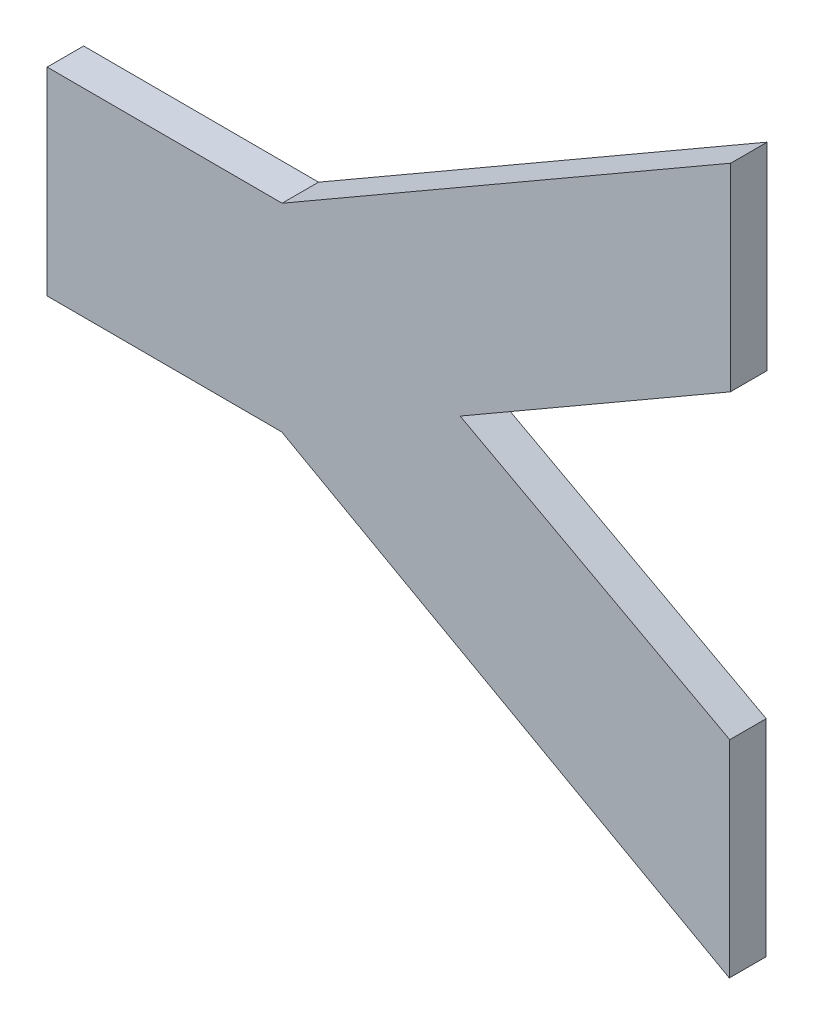
ISO-10303-21;
HEADER;
FILE_DESCRIPTION(('STEP AP214'),'2;1');
FILE_NAME('part.step','',(''),(''),'','','');
FILE_SCHEMA(('AUTOMOTIVE_DESIGN { 1 0 10303 214 1 1 1 1 }'));
ENDSEC;
DATA;
#1=APPLICATION_CONTEXT('core data for automotive mechanical design processes');
#2=APPLICATION_PROTOCOL_DEFINITION('international standard','automotive_design',2000,#1);
#3=PRODUCT_CONTEXT('',#1,'mechanical');
#4=PRODUCT('Part','Part','',(#3));
#5=PRODUCT_RELATED_PRODUCT_CATEGORY('part','',(#4));
#6=PRODUCT_DEFINITION_FORMATION('','',#4);
#7=PRODUCT_DEFINITION_CONTEXT('part definition',#1,'design');
#8=PRODUCT_DEFINITION('design','',#6,#7);
#9=PRODUCT_DEFINITION_SHAPE('','',#8);
#10=(LENGTH_UNIT() NAMED_UNIT(*) SI_UNIT(.MILLI.,.METRE.));
#11=(NAMED_UNIT(*) PLANE_ANGLE_UNIT() SI_UNIT($,.RADIAN.));
#12=(NAMED_UNIT(*) SI_UNIT($,.STERADIAN.) SOLID_ANGLE_UNIT());
#13=UNCERTAINTY_MEASURE_WITH_UNIT(LENGTH_MEASURE(1.E-05),#10,'distance_accuracy_value','');
#14=(GEOMETRIC_REPRESENTATION_CONTEXT(3) GLOBAL_UNCERTAINTY_ASSIGNED_CONTEXT((#13)) GLOBAL_UNIT_ASSIGNED_CONTEXT((#10,
#11,#12)) REPRESENTATION_CONTEXT('',''));
#15=CARTESIAN_POINT('',(0.,0.,0.));
#16=DIRECTION('',(0.,0.,1.));
#17=DIRECTION('',(1.,0.,0.));
#18=AXIS2_PLACEMENT_3D('',#15,#16,#17);
#19=CARTESIAN_POINT('',(-0.176957192412927,0.0781727937247201,-0.37));
#20=DIRECTION('',(0.500136953174427,-0.865946319392491,0.));
#21=DIRECTION('',(-0.865946319392491,-0.500136953174427,0.));
#22=AXIS2_PLACEMENT_3D('',#19,#20,#21);
#23=PLANE('',#22);
#24=DIRECTION('',(-0.865946319392491,-0.500136953174427,0.));
#25=VECTOR('',#24,1.);
#26=CARTESIAN_POINT('',(-0.176957192412927,0.0781727937247201,-0.37));
#27=LINE('',#26,#25);
#28=CARTESIAN_POINT('',(-0.176957192412927,0.0781727937247201,-0.37));
#29=VERTEX_POINT('',#28);
#30=CARTESIAN_POINT('',(-0.199172756407364,0.0653419470077734,-0.37));
#31=VERTEX_POINT('',#30);
#32=EDGE_CURVE('E11',#29,#31,#27,.T.);
#33=ORIENTED_EDGE('',*,*,#32,.T.);
#34=DIRECTION('',(0.,0.,-1.));
#35=VECTOR('',#34,1.);
#36=CARTESIAN_POINT('',(-0.199172756407364,0.0653419470077734,-0.37));
#37=LINE('',#36,#35);
#38=CARTESIAN_POINT('',(-0.199172756407364,0.0653419470077734,-0.373));
#39=VERTEX_POINT('',#38);
#40=EDGE_CURVE('E24',#31,#39,#37,.T.);
#41=ORIENTED_EDGE('',*,*,#40,.T.);
#42=DIRECTION('',(-0.865946319392491,-0.500136953174427,0.));
#43=VECTOR('',#42,1.);
#44=CARTESIAN_POINT('',(-0.176957192412927,0.0781727937247201,-0.373));
#45=LINE('',#44,#43);
#46=CARTESIAN_POINT('',(-0.176957192412927,0.0781727937247201,-0.373));
#47=VERTEX_POINT('',#46);
#48=EDGE_CURVE('E106',#47,#39,#45,.T.);
#49=ORIENTED_EDGE('',*,*,#48,.F.);
#50=DIRECTION('',(0.,0.,-1.));
#51=VECTOR('',#50,1.);
#52=CARTESIAN_POINT('',(-0.176957192412927,0.0781727937247201,-0.37));
#53=LINE('',#52,#51);
#54=EDGE_CURVE('E161',#29,#47,#53,.T.);
#55=ORIENTED_EDGE('',*,*,#54,.F.);
#56=EDGE_LOOP('',(#33,#41,#49,#55));
#57=FACE_BOUND('',#56,.T.);
#58=ADVANCED_FACE('F17',(#57),#23,.T.);
#59=CARTESIAN_POINT('',(-0.176925003119448,0.0944718361057899,-0.37));
#60=DIRECTION('',(0.999998049852571,-0.0019749154553029,0.));
#61=DIRECTION('',(-0.0019749154553029,-0.999998049852571,0.));
#62=AXIS2_PLACEMENT_3D('',#59,#60,#61);
#63=PLANE('',#62);
#64=DIRECTION('',(-0.0019749154553029,-0.999998049852571,0.));
#65=VECTOR('',#64,1.);
#66=CARTESIAN_POINT('',(-0.176925003119448,0.0944718361057899,-0.37));
#67=LINE('',#66,#65);
#68=CARTESIAN_POINT('',(-0.176925003119448,0.0944718361057899,-0.37));
#69=VERTEX_POINT('',#68);
#70=EDGE_CURVE('E158',#69,#29,#67,.T.);
#71=ORIENTED_EDGE('',*,*,#70,.T.);
#72=ORIENTED_EDGE('',*,*,#54,.T.);
#73=DIRECTION('',(-0.0019749154553029,-0.999998049852571,0.));
#74=VECTOR('',#73,1.);
#75=CARTESIAN_POINT('',(-0.176925003119448,0.0944718361057899,-0.373));
#76=LINE('',#75,#74);
#77=CARTESIAN_POINT('',(-0.176925003119448,0.0944718361057899,-0.373));
#78=VERTEX_POINT('',#77);
#79=EDGE_CURVE('E156',#78,#47,#76,.T.);
#80=ORIENTED_EDGE('',*,*,#79,.F.);
#81=DIRECTION('',(0.,0.,-1.));
#82=VECTOR('',#81,1.);
#83=CARTESIAN_POINT('',(-0.176925003119448,0.0944718361057899,-0.37));
#84=LINE('',#83,#82);
#85=EDGE_CURVE('E153',#69,#78,#84,.T.);
#86=ORIENTED_EDGE('',*,*,#85,.F.);
#87=EDGE_LOOP('',(#71,#72,#80,#86));
#88=FACE_BOUND('',#87,.T.);
#89=ADVANCED_FACE('F181',(#88),#63,.T.);
#90=CARTESIAN_POINT('',(-0.213813050896857,0.0731778596143159,-0.37));
#91=DIRECTION('',(-0.49994104857974,0.866059436727636,0.));
#92=DIRECTION('',(0.866059436727636,0.49994104857974,0.));
#93=AXIS2_PLACEMENT_3D('',#90,#91,#92);
#94=PLANE('',#93);
#95=DIRECTION('',(0.866059436727636,0.49994104857974,0.));
#96=VECTOR('',#95,1.);
#97=CARTESIAN_POINT('',(-0.213813050896857,0.0731778596143159,-0.37));
#98=LINE('',#97,#96);
#99=CARTESIAN_POINT('',(-0.213813050896857,0.0731778596143159,-0.37));
#100=VERTEX_POINT('',#99);
#101=EDGE_CURVE('E150',#100,#69,#98,.T.);
#102=ORIENTED_EDGE('',*,*,#101,.T.);
#103=ORIENTED_EDGE('',*,*,#85,.T.);
#104=DIRECTION('',(0.866059436727636,0.49994104857974,0.));
#105=VECTOR('',#104,1.);
#106=CARTESIAN_POINT('',(-0.213813050896857,0.0731778596143159,-0.373));
#107=LINE('',#106,#105);
#108=CARTESIAN_POINT('',(-0.213813050896857,0.0731778596143159,-0.373));
#109=VERTEX_POINT('',#108);
#110=EDGE_CURVE('E147',#109,#78,#107,.T.);
#111=ORIENTED_EDGE('',*,*,#110,.F.);
#112=DIRECTION('',(0.,0.,-1.));
#113=VECTOR('',#112,1.);
#114=CARTESIAN_POINT('',(-0.213813050896857,0.0731778596143159,-0.37));
#115=LINE('',#114,#113);
#116=EDGE_CURVE('E144',#100,#109,#115,.T.);
#117=ORIENTED_EDGE('',*,*,#116,.F.);
#118=EDGE_LOOP('',(#102,#103,#111,#117));
#119=FACE_BOUND('',#118,.T.);
#120=ADVANCED_FACE('F178',(#119),#94,.T.);
#121=CARTESIAN_POINT('',(-0.233126208974028,0.0732160015430742,-0.37));
#122=DIRECTION('',(0.0019749154552307,0.999998049852571,0.));
#123=DIRECTION('',(0.999998049852571,-0.0019749154552307,0.));
#124=AXIS2_PLACEMENT_3D('',#121,#122,#123);
#125=PLANE('',#124);
#126=DIRECTION('',(0.999998049852571,-0.0019749154552307,0.));
#127=VECTOR('',#126,1.);
#128=CARTESIAN_POINT('',(-0.233126208974028,0.0732160015430742,-0.37));
#129=LINE('',#128,#127);
#130=CARTESIAN_POINT('',(-0.233126208974028,0.0732160015430742,-0.37));
#131=VERTEX_POINT('',#130);
#132=EDGE_CURVE('E141',#131,#100,#129,.T.);
#133=ORIENTED_EDGE('',*,*,#132,.T.);
#134=ORIENTED_EDGE('',*,*,#116,.T.);
#135=DIRECTION('',(0.999998049852571,-0.0019749154552307,0.));
#136=VECTOR('',#135,1.);
#137=CARTESIAN_POINT('',(-0.233126208974028,0.0732160015430742,-0.373));
#138=LINE('',#137,#136);
#139=CARTESIAN_POINT('',(-0.233126208974028,0.0732160015430742,-0.373));
#140=VERTEX_POINT('',#139);
#141=EDGE_CURVE('E138',#140,#109,#138,.T.);
#142=ORIENTED_EDGE('',*,*,#141,.F.);
#143=DIRECTION('',(0.,0.,-1.));
#144=VECTOR('',#143,1.);
#145=CARTESIAN_POINT('',(-0.233126208974028,0.0732160015430742,-0.37));
#146=LINE('',#145,#144);
#147=EDGE_CURVE('E135',#131,#140,#146,.T.);
#148=ORIENTED_EDGE('',*,*,#147,.F.);
#149=EDGE_LOOP('',(#133,#134,#142,#148));
#150=FACE_BOUND('',#149,.T.);
#151=ADVANCED_FACE('F175',(#150),#125,.T.);
#152=CARTESIAN_POINT('',(-0.23315839940546,0.0569163829593786,-0.37));
#153=DIRECTION('',(-0.999998049852571,0.0019749154552519,0.));
#154=DIRECTION('',(0.0019749154552519,0.999998049852571,0.));
#155=AXIS2_PLACEMENT_3D('',#152,#153,#154);
#156=PLANE('',#155);
#157=DIRECTION('',(0.0019749154552519,0.999998049852571,0.));
#158=VECTOR('',#157,1.);
#159=CARTESIAN_POINT('',(-0.23315839940546,0.0569163829593786,-0.37));
#160=LINE('',#159,#158);
#161=CARTESIAN_POINT('',(-0.23315839940546,0.0569163829593786,-0.37));
#162=VERTEX_POINT('',#161);
#163=EDGE_CURVE('E132',#162,#131,#160,.T.);
#164=ORIENTED_EDGE('',*,*,#163,.T.);
#165=ORIENTED_EDGE('',*,*,#147,.T.);
#166=DIRECTION('',(0.0019749154552519,0.999998049852571,0.));
#167=VECTOR('',#166,1.);
#168=CARTESIAN_POINT('',(-0.23315839940546,0.0569163829593786,-0.373));
#169=LINE('',#168,#167);
#170=CARTESIAN_POINT('',(-0.23315839940546,0.0569163829593786,-0.373));
#171=VERTEX_POINT('',#170);
#172=EDGE_CURVE('E129',#171,#140,#169,.T.);
#173=ORIENTED_EDGE('',*,*,#172,.F.);
#174=DIRECTION('',(0.,0.,-1.));
#175=VECTOR('',#174,1.);
#176=CARTESIAN_POINT('',(-0.23315839940546,0.0569163829593786,-0.37));
#177=LINE('',#176,#175);
#178=EDGE_CURVE('E126',#162,#171,#177,.T.);
#179=ORIENTED_EDGE('',*,*,#178,.F.);
#180=EDGE_LOOP('',(#164,#165,#173,#179));
#181=FACE_BOUND('',#180,.T.);
#182=ADVANCED_FACE('F172',(#181),#156,.T.);
#183=CARTESIAN_POINT('',(-0.213845241328289,0.0568782410306203,-0.37));
#184=DIRECTION('',(-0.0019749154552312,-0.999998049852571,0.));
#185=DIRECTION('',(-0.999998049852571,0.0019749154552312,0.));
#186=AXIS2_PLACEMENT_3D('',#183,#184,#185);
#187=PLANE('',#186);
#188=DIRECTION('',(-0.999998049852571,0.0019749154552312,0.));
#189=VECTOR('',#188,1.);
#190=CARTESIAN_POINT('',(-0.213845241328289,0.0568782410306203,-0.37));
#191=LINE('',#190,#189);
#192=CARTESIAN_POINT('',(-0.213845241328289,0.0568782410306203,-0.37));
#193=VERTEX_POINT('',#192);
#194=EDGE_CURVE('E123',#193,#162,#191,.T.);
#195=ORIENTED_EDGE('',*,*,#194,.T.);
#196=ORIENTED_EDGE('',*,*,#178,.T.);
#197=DIRECTION('',(-0.999998049852571,0.0019749154552312,0.));
#198=VECTOR('',#197,1.);
#199=CARTESIAN_POINT('',(-0.213845241328289,0.0568782410306203,-0.373));
#200=LINE('',#199,#198);
#201=CARTESIAN_POINT('',(-0.213845241328289,0.0568782410306203,-0.373));
#202=VERTEX_POINT('',#201);
#203=EDGE_CURVE('E120',#202,#171,#200,.T.);
#204=ORIENTED_EDGE('',*,*,#203,.F.);
#205=DIRECTION('',(0.,0.,-1.));
#206=VECTOR('',#205,1.);
#207=CARTESIAN_POINT('',(-0.213845241328289,0.0568782410306203,-0.37));
#208=LINE('',#207,#206);
#209=EDGE_CURVE('E117',#193,#202,#208,.T.);
#210=ORIENTED_EDGE('',*,*,#209,.F.);
#211=EDGE_LOOP('',(#195,#196,#204,#210));
#212=FACE_BOUND('',#211,.T.);
#213=ADVANCED_FACE('F169',(#212),#187,.T.);
#214=CARTESIAN_POINT('',(-0.177039697462775,0.036396378065382,-0.37));
#215=DIRECTION('',(-0.486265776131108,-0.873810960656601,0.));
#216=DIRECTION('',(-0.873810960656601,0.486265776131108,0.));
#217=AXIS2_PLACEMENT_3D('',#214,#215,#216);
#218=PLANE('',#217);
#219=DIRECTION('',(-0.873810960656601,0.486265776131108,0.));
#220=VECTOR('',#219,1.);
#221=CARTESIAN_POINT('',(-0.177039697462775,0.036396378065382,-0.37));
#222=LINE('',#221,#220);
#223=CARTESIAN_POINT('',(-0.177039697462775,0.0363963780653821,-0.37));
#224=VERTEX_POINT('',#223);
#225=EDGE_CURVE('E114',#224,#193,#222,.T.);
#226=ORIENTED_EDGE('',*,*,#225,.T.);
#227=ORIENTED_EDGE('',*,*,#209,.T.);
#228=DIRECTION('',(-0.873810960656601,0.486265776131108,0.));
#229=VECTOR('',#228,1.);
#230=CARTESIAN_POINT('',(-0.177039697462775,0.036396378065382,-0.373));
#231=LINE('',#230,#229);
#232=CARTESIAN_POINT('',(-0.177039697462775,0.0363963780653821,-0.373));
#233=VERTEX_POINT('',#232);
#234=EDGE_CURVE('E112',#233,#202,#231,.T.);
#235=ORIENTED_EDGE('',*,*,#234,.F.);
#236=DIRECTION('',(0.,0.,-1.));
#237=VECTOR('',#236,1.);
#238=CARTESIAN_POINT('',(-0.177039697462775,0.0363963780653821,-0.37));
#239=LINE('',#238,#237);
#240=EDGE_CURVE('E91',#224,#233,#239,.T.);
#241=ORIENTED_EDGE('',*,*,#240,.F.);
#242=EDGE_LOOP('',(#226,#227,#235,#241));
#243=FACE_BOUND('',#242,.T.);
#244=ADVANCED_FACE('F167',(#243),#218,.T.);
#245=CARTESIAN_POINT('',(-0.177006152866559,0.0533816777192288,-0.37));
#246=DIRECTION('',(0.999998049852571,-0.0019749154552604,0.));
#247=DIRECTION('',(-0.0019749154552604,-0.999998049852571,0.));
#248=AXIS2_PLACEMENT_3D('',#245,#246,#247);
#249=PLANE('',#248);
#250=DIRECTION('',(-0.0019749154552604,-0.999998049852571,0.));
#251=VECTOR('',#250,1.);
#252=CARTESIAN_POINT('',(-0.177006152866559,0.0533816777192288,-0.37));
#253=LINE('',#252,#251);
#254=CARTESIAN_POINT('',(-0.177006152866559,0.0533816777192288,-0.37));
#255=VERTEX_POINT('',#254);
#256=EDGE_CURVE('E95',#255,#224,#253,.T.);
#257=ORIENTED_EDGE('',*,*,#256,.T.);
#258=ORIENTED_EDGE('',*,*,#240,.T.);
#259=DIRECTION('',(-0.0019749154552604,-0.999998049852571,0.));
#260=VECTOR('',#259,1.);
#261=CARTESIAN_POINT('',(-0.177006152866559,0.0533816777192288,-0.373));
#262=LINE('',#261,#260);
#263=CARTESIAN_POINT('',(-0.177006152866559,0.0533816777192288,-0.373));
#264=VERTEX_POINT('',#263);
#265=EDGE_CURVE('E84',#264,#233,#262,.T.);
#266=ORIENTED_EDGE('',*,*,#265,.F.);
#267=DIRECTION('',(0.,0.,-1.));
#268=VECTOR('',#267,1.);
#269=CARTESIAN_POINT('',(-0.177006152866559,0.0533816777192288,-0.37));
#270=LINE('',#269,#268);
#271=EDGE_CURVE('E88',#255,#264,#270,.T.);
#272=ORIENTED_EDGE('',*,*,#271,.F.);
#273=EDGE_LOOP('',(#257,#258,#266,#272));
#274=FACE_BOUND('',#273,.T.);
#275=ADVANCED_FACE('F87',(#274),#249,.T.);
#276=CARTESIAN_POINT('',(-0.199172756407364,0.0653419470077734,-0.37));
#277=DIRECTION('',(0.474850824016555,0.880066301440294,0.));
#278=DIRECTION('',(0.880066301440294,-0.474850824016555,0.));
#279=AXIS2_PLACEMENT_3D('',#276,#277,#278);
#280=PLANE('',#279);
#281=DIRECTION('',(0.880066301440295,-0.474850824016555,0.));
#282=VECTOR('',#281,1.);
#283=CARTESIAN_POINT('',(-0.199172756407364,0.0653419470077734,-0.37));
#284=LINE('',#283,#282);
#285=EDGE_CURVE('E101',#31,#255,#284,.T.);
#286=ORIENTED_EDGE('',*,*,#285,.T.);
#287=ORIENTED_EDGE('',*,*,#271,.T.);
#288=DIRECTION('',(0.880066301440295,-0.474850824016555,0.));
#289=VECTOR('',#288,1.);
#290=CARTESIAN_POINT('',(-0.199172756407364,0.0653419470077734,-0.373));
#291=LINE('',#290,#289);
#292=EDGE_CURVE('E100',#39,#264,#291,.T.);
#293=ORIENTED_EDGE('',*,*,#292,.F.);
#294=ORIENTED_EDGE('',*,*,#40,.F.);
#295=EDGE_LOOP('',(#286,#287,#293,#294));
#296=FACE_BOUND('',#295,.T.);
#297=ADVANCED_FACE('F99',(#296),#280,.T.);
#298=CARTESIAN_POINT('',(-0.205041701262454,0.065434107085586,-0.373));
#299=DIRECTION('',(0.,0.,-1.));
#300=DIRECTION('',(-1.,0.,0.));
#301=AXIS2_PLACEMENT_3D('',#298,#299,#300);
#302=PLANE('',#301);
#303=ORIENTED_EDGE('',*,*,#292,.T.);
#304=ORIENTED_EDGE('',*,*,#265,.T.);
#305=ORIENTED_EDGE('',*,*,#234,.T.);
#306=ORIENTED_EDGE('',*,*,#203,.T.);
#307=ORIENTED_EDGE('',*,*,#172,.T.);
#308=ORIENTED_EDGE('',*,*,#141,.T.);
#309=ORIENTED_EDGE('',*,*,#110,.T.);
#310=ORIENTED_EDGE('',*,*,#79,.T.);
#311=ORIENTED_EDGE('',*,*,#48,.T.);
#312=EDGE_LOOP('',(#303,#304,#305,#306,#307,#308,#309,#310,#311));
#313=FACE_BOUND('',#312,.T.);
#314=ADVANCED_FACE('F104',(#313),#302,.T.);
#315=CARTESIAN_POINT('',(-0.205041701262454,0.065434107085586,-0.37));
#316=DIRECTION('',(0.,0.,-1.));
#317=DIRECTION('',(-1.,0.,0.));
#318=AXIS2_PLACEMENT_3D('',#315,#316,#317);
#319=PLANE('',#318);
#320=ORIENTED_EDGE('',*,*,#285,.F.);
#321=ORIENTED_EDGE('',*,*,#32,.F.);
#322=ORIENTED_EDGE('',*,*,#70,.F.);
#323=ORIENTED_EDGE('',*,*,#101,.F.);
#324=ORIENTED_EDGE('',*,*,#132,.F.);
#325=ORIENTED_EDGE('',*,*,#163,.F.);
#326=ORIENTED_EDGE('',*,*,#194,.F.);
#327=ORIENTED_EDGE('',*,*,#225,.F.);
#328=ORIENTED_EDGE('',*,*,#256,.F.);
#329=EDGE_LOOP('',(#320,#321,#322,#323,#324,#325,#326,#327,#328));
#330=FACE_BOUND('',#329,.T.);
#331=ADVANCED_FACE('F164',(#330),#319,.F.);
#332=CLOSED_SHELL('',(#58,#89,#120,#151,#182,#213,#244,#275,#297,#314,#331));
#333=MANIFOLD_SOLID_BREP('B1',#332);
#334=ADVANCED_BREP_SHAPE_REPRESENTATION('',(#18,#333),#14);
#335=SHAPE_DEFINITION_REPRESENTATION(#9,#334);
ENDSEC;
END-ISO-10303-21;
